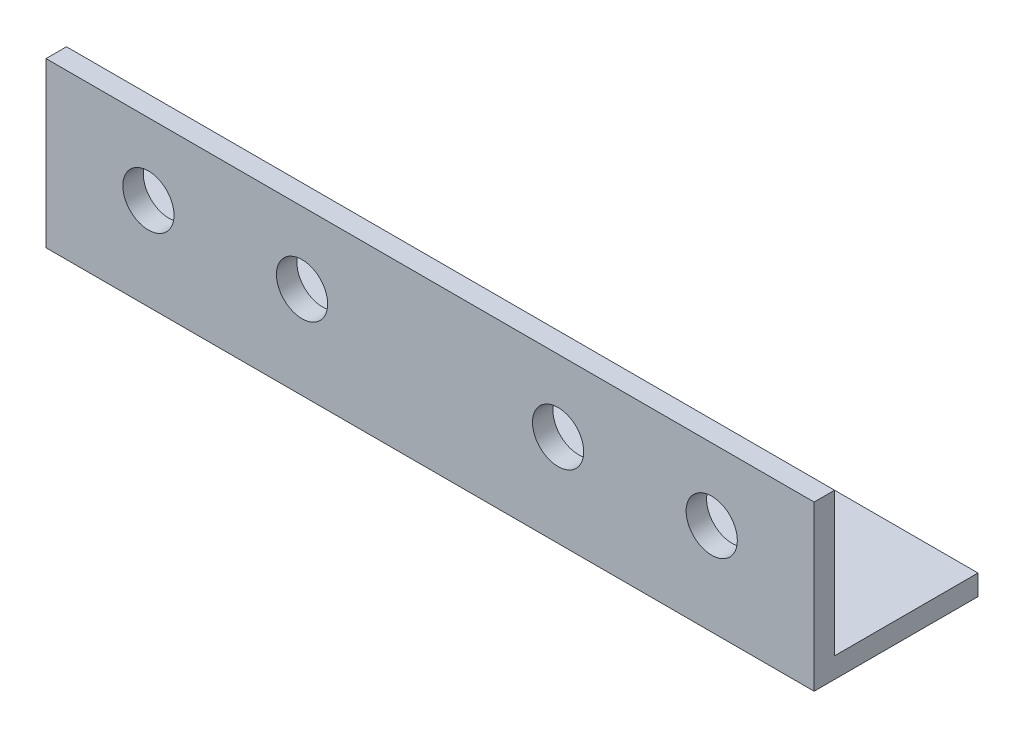
ISO-10303-21;
HEADER;
FILE_DESCRIPTION(('STEP AP214'),'2;1');
FILE_NAME('part.step','',(''),(''),'','','');
FILE_SCHEMA(('AUTOMOTIVE_DESIGN { 1 0 10303 214 1 1 1 1 }'));
ENDSEC;
DATA;
#1=APPLICATION_CONTEXT('core data for automotive mechanical design processes');
#2=APPLICATION_PROTOCOL_DEFINITION('international standard','automotive_design',2000,#1);
#3=PRODUCT_CONTEXT('',#1,'mechanical');
#4=PRODUCT('Part','Part','',(#3));
#5=PRODUCT_RELATED_PRODUCT_CATEGORY('part','',(#4));
#6=PRODUCT_DEFINITION_FORMATION('','',#4);
#7=PRODUCT_DEFINITION_CONTEXT('part definition',#1,'design');
#8=PRODUCT_DEFINITION('design','',#6,#7);
#9=PRODUCT_DEFINITION_SHAPE('','',#8);
#10=(LENGTH_UNIT() NAMED_UNIT(*) SI_UNIT(.MILLI.,.METRE.));
#11=(NAMED_UNIT(*) PLANE_ANGLE_UNIT() SI_UNIT($,.RADIAN.));
#12=(NAMED_UNIT(*) SI_UNIT($,.STERADIAN.) SOLID_ANGLE_UNIT());
#13=UNCERTAINTY_MEASURE_WITH_UNIT(LENGTH_MEASURE(1.E-05),#10,'distance_accuracy_value','');
#14=(GEOMETRIC_REPRESENTATION_CONTEXT(3) GLOBAL_UNCERTAINTY_ASSIGNED_CONTEXT((#13)) GLOBAL_UNIT_ASSIGNED_CONTEXT((#10,
#11,#12)) REPRESENTATION_CONTEXT('',''));
#15=CARTESIAN_POINT('',(0.,0.,0.));
#16=DIRECTION('',(0.,0.,1.));
#17=DIRECTION('',(1.,0.,0.));
#18=AXIS2_PLACEMENT_3D('',#15,#16,#17);
#19=CARTESIAN_POINT('',(150.,0.,0.));
#20=DIRECTION('',(0.,1.,0.));
#21=DIRECTION('',(0.,0.,1.));
#22=AXIS2_PLACEMENT_3D('',#19,#20,#21);
#23=PLANE('',#22);
#24=DIRECTION('',(0.,0.,-1.));
#25=VECTOR('',#24,1.);
#26=CARTESIAN_POINT('',(0.,0.,0.));
#27=LINE('',#26,#25);
#28=CARTESIAN_POINT('',(0.,0.,0.));
#29=VERTEX_POINT('',#28);
#30=CARTESIAN_POINT('',(0.,0.,-32.));
#31=VERTEX_POINT('',#30);
#32=EDGE_CURVE('E115',#29,#31,#27,.T.);
#33=ORIENTED_EDGE('',*,*,#32,.T.);
#34=DIRECTION('',(-1.,0.,0.));
#35=VECTOR('',#34,1.);
#36=CARTESIAN_POINT('',(150.,0.,-32.));
#37=LINE('',#36,#35);
#38=CARTESIAN_POINT('',(150.,0.,-32.));
#39=VERTEX_POINT('',#38);
#40=EDGE_CURVE('E11',#39,#31,#37,.T.);
#41=ORIENTED_EDGE('',*,*,#40,.F.);
#42=DIRECTION('',(0.,0.,-1.));
#43=VECTOR('',#42,1.);
#44=CARTESIAN_POINT('',(150.,0.,0.));
#45=LINE('',#44,#43);
#46=CARTESIAN_POINT('',(150.,0.,0.));
#47=VERTEX_POINT('',#46);
#48=EDGE_CURVE('E80',#47,#39,#45,.T.);
#49=ORIENTED_EDGE('',*,*,#48,.F.);
#50=DIRECTION('',(-1.,0.,0.));
#51=VECTOR('',#50,1.);
#52=CARTESIAN_POINT('',(150.,0.,0.));
#53=LINE('',#52,#51);
#54=EDGE_CURVE('E111',#47,#29,#53,.T.);
#55=ORIENTED_EDGE('',*,*,#54,.T.);
#56=EDGE_LOOP('',(#33,#41,#49,#55));
#57=FACE_BOUND('',#56,.T.);
#58=ADVANCED_FACE('F34',(#57),#23,.F.);
#59=CARTESIAN_POINT('',(150.,4.,-32.));
#60=DIRECTION('',(0.,0.,-1.));
#61=DIRECTION('',(-1.,0.,0.));
#62=AXIS2_PLACEMENT_3D('',#59,#60,#61);
#63=PLANE('',#62);
#64=DIRECTION('',(0.,-1.,0.));
#65=VECTOR('',#64,1.);
#66=CARTESIAN_POINT('',(0.,4.,-32.));
#67=LINE('',#66,#65);
#68=CARTESIAN_POINT('',(0.,4.,-32.));
#69=VERTEX_POINT('',#68);
#70=EDGE_CURVE('E118',#69,#31,#67,.T.);
#71=ORIENTED_EDGE('',*,*,#70,.F.);
#72=DIRECTION('',(-1.,0.,0.));
#73=VECTOR('',#72,1.);
#74=CARTESIAN_POINT('',(150.,4.,-32.));
#75=LINE('',#74,#73);
#76=CARTESIAN_POINT('',(150.,4.,-32.));
#77=VERTEX_POINT('',#76);
#78=EDGE_CURVE('E42',#77,#69,#75,.T.);
#79=ORIENTED_EDGE('',*,*,#78,.F.);
#80=DIRECTION('',(0.,-1.,0.));
#81=VECTOR('',#80,1.);
#82=CARTESIAN_POINT('',(150.,4.,-32.));
#83=LINE('',#82,#81);
#84=EDGE_CURVE('E193',#77,#39,#83,.T.);
#85=ORIENTED_EDGE('',*,*,#84,.T.);
#86=ORIENTED_EDGE('',*,*,#40,.T.);
#87=EDGE_LOOP('',(#71,#79,#85,#86));
#88=FACE_BOUND('',#87,.T.);
#89=ADVANCED_FACE('F137',(#88),#63,.T.);
#90=CARTESIAN_POINT('',(150.,4.,0.));
#91=DIRECTION('',(0.,1.,0.));
#92=DIRECTION('',(0.,0.,1.));
#93=AXIS2_PLACEMENT_3D('',#90,#91,#92);
#94=PLANE('',#93);
#95=DIRECTION('',(0.,0.,-1.));
#96=VECTOR('',#95,1.);
#97=CARTESIAN_POINT('',(0.,4.,0.));
#98=LINE('',#97,#96);
#99=CARTESIAN_POINT('',(0.,4.,-4.));
#100=VERTEX_POINT('',#99);
#101=EDGE_CURVE('E122',#100,#69,#98,.T.);
#102=ORIENTED_EDGE('',*,*,#101,.F.);
#103=DIRECTION('',(-1.,0.,0.));
#104=VECTOR('',#103,1.);
#105=CARTESIAN_POINT('',(150.,4.,-4.));
#106=LINE('',#105,#104);
#107=CARTESIAN_POINT('',(150.,4.,-4.));
#108=VERTEX_POINT('',#107);
#109=EDGE_CURVE('E101',#108,#100,#106,.T.);
#110=ORIENTED_EDGE('',*,*,#109,.F.);
#111=DIRECTION('',(0.,0.,-1.));
#112=VECTOR('',#111,1.);
#113=CARTESIAN_POINT('',(150.,4.,0.));
#114=LINE('',#113,#112);
#115=EDGE_CURVE('E107',#108,#77,#114,.T.);
#116=ORIENTED_EDGE('',*,*,#115,.T.);
#117=ORIENTED_EDGE('',*,*,#78,.T.);
#118=EDGE_LOOP('',(#102,#110,#116,#117));
#119=FACE_BOUND('',#118,.T.);
#120=ADVANCED_FACE('F134',(#119),#94,.T.);
#121=CARTESIAN_POINT('',(150.,32.,-4.));
#122=DIRECTION('',(0.,0.,-1.));
#123=DIRECTION('',(0.,1.,0.));
#124=AXIS2_PLACEMENT_3D('',#121,#122,#123);
#125=PLANE('',#124);
#126=CARTESIAN_POINT('',(20.0000000000036,18.,-4.));
#127=DIRECTION('',(0.,0.,-1.));
#128=DIRECTION('',(0.,-1.,0.));
#129=AXIS2_PLACEMENT_3D('',#126,#127,#128);
#130=CIRCLE('',#129,4.99999999999999);
#131=CARTESIAN_POINT('',(20.0000000000036,13.,-4.));
#132=VERTEX_POINT('',#131);
#133=EDGE_CURVE('E171',#132,#132,#130,.T.);
#134=ORIENTED_EDGE('',*,*,#133,.F.);
#135=EDGE_LOOP('',(#134));
#136=FACE_BOUND('',#135,.T.);
#137=CARTESIAN_POINT('',(50.0000000000036,18.,-4.));
#138=DIRECTION('',(0.,0.,-1.));
#139=DIRECTION('',(0.,-1.,0.));
#140=AXIS2_PLACEMENT_3D('',#137,#138,#139);
#141=CIRCLE('',#140,4.99999999999999);
#142=CARTESIAN_POINT('',(50.0000000000036,13.,-4.));
#143=VERTEX_POINT('',#142);
#144=EDGE_CURVE('E175',#143,#143,#141,.T.);
#145=ORIENTED_EDGE('',*,*,#144,.F.);
#146=EDGE_LOOP('',(#145));
#147=FACE_BOUND('',#146,.T.);
#148=CARTESIAN_POINT('',(100.,18.,-4.));
#149=DIRECTION('',(0.,0.,-1.));
#150=DIRECTION('',(0.,1.,0.));
#151=AXIS2_PLACEMENT_3D('',#148,#149,#150);
#152=CIRCLE('',#151,4.99999999999999);
#153=CARTESIAN_POINT('',(100.,23.,-4.));
#154=VERTEX_POINT('',#153);
#155=EDGE_CURVE('E179',#154,#154,#152,.T.);
#156=ORIENTED_EDGE('',*,*,#155,.F.);
#157=EDGE_LOOP('',(#156));
#158=FACE_BOUND('',#157,.T.);
#159=CARTESIAN_POINT('',(130.,18.,-4.));
#160=DIRECTION('',(0.,0.,-1.));
#161=DIRECTION('',(0.,1.,0.));
#162=AXIS2_PLACEMENT_3D('',#159,#160,#161);
#163=CIRCLE('',#162,4.99999999999999);
#164=CARTESIAN_POINT('',(130.,23.,-4.));
#165=VERTEX_POINT('',#164);
#166=EDGE_CURVE('E182',#165,#165,#163,.T.);
#167=ORIENTED_EDGE('',*,*,#166,.F.);
#168=EDGE_LOOP('',(#167));
#169=FACE_BOUND('',#168,.T.);
#170=DIRECTION('',(0.,-1.,0.));
#171=VECTOR('',#170,1.);
#172=CARTESIAN_POINT('',(0.,32.,-4.));
#173=LINE('',#172,#171);
#174=CARTESIAN_POINT('',(0.,32.,-4.));
#175=VERTEX_POINT('',#174);
#176=EDGE_CURVE('E96',#175,#100,#173,.T.);
#177=ORIENTED_EDGE('',*,*,#176,.F.);
#178=DIRECTION('',(-1.,0.,0.));
#179=VECTOR('',#178,1.);
#180=CARTESIAN_POINT('',(150.,32.,-4.));
#181=LINE('',#180,#179);
#182=CARTESIAN_POINT('',(150.,32.,-4.));
#183=VERTEX_POINT('',#182);
#184=EDGE_CURVE('E91',#183,#175,#181,.T.);
#185=ORIENTED_EDGE('',*,*,#184,.F.);
#186=DIRECTION('',(0.,-1.,0.));
#187=VECTOR('',#186,1.);
#188=CARTESIAN_POINT('',(150.,32.,-4.));
#189=LINE('',#188,#187);
#190=EDGE_CURVE('E94',#183,#108,#189,.T.);
#191=ORIENTED_EDGE('',*,*,#190,.T.);
#192=ORIENTED_EDGE('',*,*,#109,.T.);
#193=EDGE_LOOP('',(#177,#185,#191,#192));
#194=FACE_BOUND('',#193,.T.);
#195=ADVANCED_FACE('F93',(#136,#147,#158,#169,#194),#125,.T.);
#196=CARTESIAN_POINT('',(150.,32.,0.));
#197=DIRECTION('',(0.,1.,0.));
#198=DIRECTION('',(0.,0.,1.));
#199=AXIS2_PLACEMENT_3D('',#196,#197,#198);
#200=PLANE('',#199);
#201=DIRECTION('',(0.,0.,-1.));
#202=VECTOR('',#201,1.);
#203=CARTESIAN_POINT('',(0.,32.,0.));
#204=LINE('',#203,#202);
#205=CARTESIAN_POINT('',(0.,32.,0.));
#206=VERTEX_POINT('',#205);
#207=EDGE_CURVE('E126',#206,#175,#204,.T.);
#208=ORIENTED_EDGE('',*,*,#207,.F.);
#209=DIRECTION('',(-1.,0.,0.));
#210=VECTOR('',#209,1.);
#211=CARTESIAN_POINT('',(150.,32.,0.));
#212=LINE('',#211,#210);
#213=CARTESIAN_POINT('',(150.,32.,0.));
#214=VERTEX_POINT('',#213);
#215=EDGE_CURVE('E71',#214,#206,#212,.T.);
#216=ORIENTED_EDGE('',*,*,#215,.F.);
#217=DIRECTION('',(0.,0.,-1.));
#218=VECTOR('',#217,1.);
#219=CARTESIAN_POINT('',(150.,32.,0.));
#220=LINE('',#219,#218);
#221=EDGE_CURVE('E105',#214,#183,#220,.T.);
#222=ORIENTED_EDGE('',*,*,#221,.T.);
#223=ORIENTED_EDGE('',*,*,#184,.T.);
#224=EDGE_LOOP('',(#208,#216,#222,#223));
#225=FACE_BOUND('',#224,.T.);
#226=ADVANCED_FACE('F109',(#225),#200,.T.);
#227=CARTESIAN_POINT('',(150.,32.,0.));
#228=DIRECTION('',(0.,0.,-1.));
#229=DIRECTION('',(0.,1.,0.));
#230=AXIS2_PLACEMENT_3D('',#227,#228,#229);
#231=PLANE('',#230);
#232=CARTESIAN_POINT('',(20.0000000000036,18.,0.));
#233=DIRECTION('',(0.,0.,-1.));
#234=DIRECTION('',(0.,-1.,0.));
#235=AXIS2_PLACEMENT_3D('',#232,#233,#234);
#236=CIRCLE('',#235,4.99999999999999);
#237=CARTESIAN_POINT('',(20.0000000000036,13.,0.));
#238=VERTEX_POINT('',#237);
#239=EDGE_CURVE('E197',#238,#238,#236,.T.);
#240=ORIENTED_EDGE('',*,*,#239,.T.);
#241=EDGE_LOOP('',(#240));
#242=FACE_BOUND('',#241,.T.);
#243=CARTESIAN_POINT('',(50.0000000000036,18.,0.));
#244=DIRECTION('',(0.,0.,-1.));
#245=DIRECTION('',(0.,-1.,0.));
#246=AXIS2_PLACEMENT_3D('',#243,#244,#245);
#247=CIRCLE('',#246,4.99999999999999);
#248=CARTESIAN_POINT('',(50.0000000000036,13.,0.));
#249=VERTEX_POINT('',#248);
#250=EDGE_CURVE('E194',#249,#249,#247,.T.);
#251=ORIENTED_EDGE('',*,*,#250,.T.);
#252=EDGE_LOOP('',(#251));
#253=FACE_BOUND('',#252,.T.);
#254=CARTESIAN_POINT('',(100.,18.,0.));
#255=DIRECTION('',(0.,0.,-1.));
#256=DIRECTION('',(0.,1.,0.));
#257=AXIS2_PLACEMENT_3D('',#254,#255,#256);
#258=CIRCLE('',#257,4.99999999999999);
#259=CARTESIAN_POINT('',(100.,23.,0.));
#260=VERTEX_POINT('',#259);
#261=EDGE_CURVE('E184',#260,#260,#258,.T.);
#262=ORIENTED_EDGE('',*,*,#261,.T.);
#263=EDGE_LOOP('',(#262));
#264=FACE_BOUND('',#263,.T.);
#265=CARTESIAN_POINT('',(130.,18.,0.));
#266=DIRECTION('',(0.,0.,-1.));
#267=DIRECTION('',(0.,1.,0.));
#268=AXIS2_PLACEMENT_3D('',#265,#266,#267);
#269=CIRCLE('',#268,4.99999999999999);
#270=CARTESIAN_POINT('',(130.,23.,0.));
#271=VERTEX_POINT('',#270);
#272=EDGE_CURVE('E119',#271,#271,#269,.T.);
#273=ORIENTED_EDGE('',*,*,#272,.T.);
#274=EDGE_LOOP('',(#273));
#275=FACE_BOUND('',#274,.T.);
#276=DIRECTION('',(0.,-1.,0.));
#277=VECTOR('',#276,1.);
#278=CARTESIAN_POINT('',(0.,32.,0.));
#279=LINE('',#278,#277);
#280=EDGE_CURVE('E74',#206,#29,#279,.T.);
#281=ORIENTED_EDGE('',*,*,#280,.T.);
#282=ORIENTED_EDGE('',*,*,#54,.F.);
#283=DIRECTION('',(0.,-1.,0.));
#284=VECTOR('',#283,1.);
#285=CARTESIAN_POINT('',(150.,32.,0.));
#286=LINE('',#285,#284);
#287=EDGE_CURVE('E50',#214,#47,#286,.T.);
#288=ORIENTED_EDGE('',*,*,#287,.F.);
#289=ORIENTED_EDGE('',*,*,#215,.T.);
#290=EDGE_LOOP('',(#281,#282,#288,#289));
#291=FACE_BOUND('',#290,.T.);
#292=ADVANCED_FACE('F142',(#242,#253,#264,#275,#291),#231,.F.);
#293=CARTESIAN_POINT('',(150.,0.,0.));
#294=DIRECTION('',(-1.,0.,0.));
#295=DIRECTION('',(0.,0.,1.));
#296=AXIS2_PLACEMENT_3D('',#293,#294,#295);
#297=PLANE('',#296);
#298=ORIENTED_EDGE('',*,*,#48,.T.);
#299=ORIENTED_EDGE('',*,*,#84,.F.);
#300=ORIENTED_EDGE('',*,*,#115,.F.);
#301=ORIENTED_EDGE('',*,*,#190,.F.);
#302=ORIENTED_EDGE('',*,*,#221,.F.);
#303=ORIENTED_EDGE('',*,*,#287,.T.);
#304=EDGE_LOOP('',(#298,#299,#300,#301,#302,#303));
#305=FACE_BOUND('',#304,.T.);
#306=ADVANCED_FACE('F104',(#305),#297,.F.);
#307=CARTESIAN_POINT('',(0.,0.,0.));
#308=DIRECTION('',(-1.,0.,0.));
#309=DIRECTION('',(0.,0.,1.));
#310=AXIS2_PLACEMENT_3D('',#307,#308,#309);
#311=PLANE('',#310);
#312=ORIENTED_EDGE('',*,*,#32,.F.);
#313=ORIENTED_EDGE('',*,*,#280,.F.);
#314=ORIENTED_EDGE('',*,*,#207,.T.);
#315=ORIENTED_EDGE('',*,*,#176,.T.);
#316=ORIENTED_EDGE('',*,*,#101,.T.);
#317=ORIENTED_EDGE('',*,*,#70,.T.);
#318=EDGE_LOOP('',(#312,#313,#314,#315,#316,#317));
#319=FACE_BOUND('',#318,.T.);
#320=ADVANCED_FACE('F140',(#319),#311,.T.);
#321=CARTESIAN_POINT('',(130.,18.,0.));
#322=DIRECTION('',(0.,0.,-1.));
#323=DIRECTION('',(0.,1.,0.));
#324=AXIS2_PLACEMENT_3D('',#321,#322,#323);
#325=CYLINDRICAL_SURFACE('',#324,4.99999999999999);
#326=ORIENTED_EDGE('',*,*,#272,.F.);
#327=EDGE_LOOP('',(#326));
#328=FACE_BOUND('',#327,.T.);
#329=ORIENTED_EDGE('',*,*,#166,.T.);
#330=EDGE_LOOP('',(#329));
#331=FACE_BOUND('',#330,.T.);
#332=ADVANCED_FACE('F217',(#328,#331),#325,.F.);
#333=CARTESIAN_POINT('',(100.,18.,0.));
#334=DIRECTION('',(0.,0.,-1.));
#335=DIRECTION('',(0.,1.,0.));
#336=AXIS2_PLACEMENT_3D('',#333,#334,#335);
#337=CYLINDRICAL_SURFACE('',#336,4.99999999999999);
#338=ORIENTED_EDGE('',*,*,#261,.F.);
#339=EDGE_LOOP('',(#338));
#340=FACE_BOUND('',#339,.T.);
#341=ORIENTED_EDGE('',*,*,#155,.T.);
#342=EDGE_LOOP('',(#341));
#343=FACE_BOUND('',#342,.T.);
#344=ADVANCED_FACE('F211',(#340,#343),#337,.F.);
#345=CARTESIAN_POINT('',(50.0000000000036,18.,0.));
#346=DIRECTION('',(0.,0.,-1.));
#347=DIRECTION('',(0.,1.,0.));
#348=AXIS2_PLACEMENT_3D('',#345,#346,#347);
#349=CYLINDRICAL_SURFACE('',#348,4.99999999999999);
#350=ORIENTED_EDGE('',*,*,#250,.F.);
#351=EDGE_LOOP('',(#350));
#352=FACE_BOUND('',#351,.T.);
#353=ORIENTED_EDGE('',*,*,#144,.T.);
#354=EDGE_LOOP('',(#353));
#355=FACE_BOUND('',#354,.T.);
#356=ADVANCED_FACE('F206',(#352,#355),#349,.F.);
#357=CARTESIAN_POINT('',(20.0000000000036,18.,0.));
#358=DIRECTION('',(0.,0.,-1.));
#359=DIRECTION('',(0.,1.,0.));
#360=AXIS2_PLACEMENT_3D('',#357,#358,#359);
#361=CYLINDRICAL_SURFACE('',#360,4.99999999999999);
#362=ORIENTED_EDGE('',*,*,#239,.F.);
#363=EDGE_LOOP('',(#362));
#364=FACE_BOUND('',#363,.T.);
#365=ORIENTED_EDGE('',*,*,#133,.T.);
#366=EDGE_LOOP('',(#365));
#367=FACE_BOUND('',#366,.T.);
#368=ADVANCED_FACE('F203',(#364,#367),#361,.F.);
#369=CLOSED_SHELL('',(#58,#89,#120,#195,#226,#292,#306,#320,#332,#344,#356,#368));
#370=MANIFOLD_SOLID_BREP('B2',#369);
#371=ADVANCED_BREP_SHAPE_REPRESENTATION('',(#18,#370),#14);
#372=SHAPE_DEFINITION_REPRESENTATION(#9,#371);
ENDSEC;
END-ISO-10303-21;
